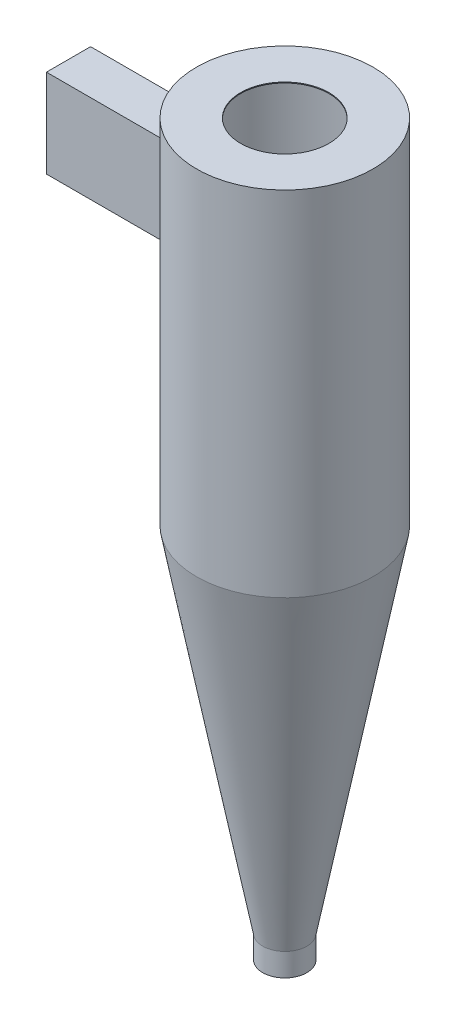
ISO-10303-21;
HEADER;
FILE_DESCRIPTION(('STEP AP214'),'2;1');
FILE_NAME('part.step','',(''),(''),'','','');
FILE_SCHEMA(('AUTOMOTIVE_DESIGN { 1 0 10303 214 1 1 1 1 }'));
ENDSEC;
DATA;
#1=APPLICATION_CONTEXT('core data for automotive mechanical design processes');
#2=APPLICATION_PROTOCOL_DEFINITION('international standard','automotive_design',2000,#1);
#3=PRODUCT_CONTEXT('',#1,'mechanical');
#4=PRODUCT('Part','Part','',(#3));
#5=PRODUCT_RELATED_PRODUCT_CATEGORY('part','',(#4));
#6=PRODUCT_DEFINITION_FORMATION('','',#4);
#7=PRODUCT_DEFINITION_CONTEXT('part definition',#1,'design');
#8=PRODUCT_DEFINITION('design','',#6,#7);
#9=PRODUCT_DEFINITION_SHAPE('','',#8);
#10=(LENGTH_UNIT() NAMED_UNIT(*) SI_UNIT(.MILLI.,.METRE.));
#11=(NAMED_UNIT(*) PLANE_ANGLE_UNIT() SI_UNIT($,.RADIAN.));
#12=(NAMED_UNIT(*) SI_UNIT($,.STERADIAN.) SOLID_ANGLE_UNIT());
#13=UNCERTAINTY_MEASURE_WITH_UNIT(LENGTH_MEASURE(1.E-05),#10,'distance_accuracy_value','');
#14=(GEOMETRIC_REPRESENTATION_CONTEXT(3) GLOBAL_UNCERTAINTY_ASSIGNED_CONTEXT((#13)) GLOBAL_UNIT_ASSIGNED_CONTEXT((#10,
#11,#12)) REPRESENTATION_CONTEXT('',''));
#15=CARTESIAN_POINT('',(0.,0.,0.));
#16=DIRECTION('',(0.,0.,1.));
#17=DIRECTION('',(1.,0.,0.));
#18=AXIS2_PLACEMENT_3D('',#15,#16,#17);
#19=CARTESIAN_POINT('',(0.,0.,105.));
#20=DIRECTION('',(0.,0.,1.));
#21=DIRECTION('',(1.,0.,0.));
#22=AXIS2_PLACEMENT_3D('',#19,#20,#21);
#23=PLANE('',#22);
#24=DIRECTION('',(1.,0.,0.));
#25=VECTOR('',#24,1.);
#26=CARTESIAN_POINT('',(0.,3535.,105.));
#27=LINE('',#26,#25);
#28=CARTESIAN_POINT('',(-1000.,3535.,105.));
#29=VERTEX_POINT('',#28);
#30=CARTESIAN_POINT('',(-483.735464897913,3535.,105.));
#31=VERTEX_POINT('',#30);
#32=EDGE_CURVE('E124',#29,#31,#27,.T.);
#33=ORIENTED_EDGE('',*,*,#32,.T.);
#34=DIRECTION('',(0.,-1.,0.));
#35=VECTOR('',#34,1.);
#36=CARTESIAN_POINT('',(-483.735464897913,0.,105.));
#37=LINE('',#36,#35);
#38=CARTESIAN_POINT('',(-483.735464897913,4025.,105.));
#39=VERTEX_POINT('',#38);
#40=EDGE_CURVE('E116',#31,#39,#37,.F.);
#41=ORIENTED_EDGE('',*,*,#40,.T.);
#42=DIRECTION('',(-1.,0.,0.));
#43=VECTOR('',#42,1.);
#44=CARTESIAN_POINT('',(0.,4025.,105.));
#45=LINE('',#44,#43);
#46=CARTESIAN_POINT('',(-1000.,4025.,105.));
#47=VERTEX_POINT('',#46);
#48=EDGE_CURVE('E115',#39,#47,#45,.T.);
#49=ORIENTED_EDGE('',*,*,#48,.T.);
#50=DIRECTION('',(0.,-1.,0.));
#51=VECTOR('',#50,1.);
#52=CARTESIAN_POINT('',(-999.999999999998,-4.44089209850062E-13,105.));
#53=LINE('',#52,#51);
#54=EDGE_CURVE('E61',#47,#29,#53,.T.);
#55=ORIENTED_EDGE('',*,*,#54,.T.);
#56=EDGE_LOOP('',(#33,#41,#49,#55));
#57=FACE_BOUND('',#56,.T.);
#58=ADVANCED_FACE('F39',(#57),#23,.T.);
#59=CARTESIAN_POINT('',(0.,0.,345.));
#60=DIRECTION('',(0.,0.,1.));
#61=DIRECTION('',(1.,0.,0.));
#62=AXIS2_PLACEMENT_3D('',#59,#60,#61);
#63=PLANE('',#62);
#64=DIRECTION('',(0.,-1.,0.));
#65=VECTOR('',#64,1.);
#66=CARTESIAN_POINT('',(-354.964786985977,0.,345.));
#67=LINE('',#66,#65);
#68=CARTESIAN_POINT('',(-354.964786985977,3535.,345.));
#69=VERTEX_POINT('',#68);
#70=CARTESIAN_POINT('',(-354.964786985977,4025.,345.));
#71=VERTEX_POINT('',#70);
#72=EDGE_CURVE('E11',#69,#71,#67,.F.);
#73=ORIENTED_EDGE('',*,*,#72,.F.);
#74=DIRECTION('',(1.,0.,0.));
#75=VECTOR('',#74,1.);
#76=CARTESIAN_POINT('',(0.,3535.,345.));
#77=LINE('',#76,#75);
#78=CARTESIAN_POINT('',(-1000.,3535.,345.));
#79=VERTEX_POINT('',#78);
#80=EDGE_CURVE('E122',#79,#69,#77,.T.);
#81=ORIENTED_EDGE('',*,*,#80,.F.);
#82=DIRECTION('',(0.,-1.,0.));
#83=VECTOR('',#82,1.);
#84=CARTESIAN_POINT('',(-999.999999999998,-4.44089209850062E-13,345.));
#85=LINE('',#84,#83);
#86=CARTESIAN_POINT('',(-1000.,4025.,345.));
#87=VERTEX_POINT('',#86);
#88=EDGE_CURVE('E120',#87,#79,#85,.T.);
#89=ORIENTED_EDGE('',*,*,#88,.F.);
#90=DIRECTION('',(-1.,0.,0.));
#91=VECTOR('',#90,1.);
#92=CARTESIAN_POINT('',(0.,4025.,345.));
#93=LINE('',#92,#91);
#94=EDGE_CURVE('E113',#71,#87,#93,.T.);
#95=ORIENTED_EDGE('',*,*,#94,.F.);
#96=EDGE_LOOP('',(#73,#81,#89,#95));
#97=FACE_BOUND('',#96,.T.);
#98=ADVANCED_FACE('F118',(#97),#63,.F.);
#99=CARTESIAN_POINT('',(-1000.,4030.,100.));
#100=DIRECTION('',(-1.,0.,0.));
#101=DIRECTION('',(0.,-1.,0.));
#102=AXIS2_PLACEMENT_3D('',#99,#100,#101);
#103=PLANE('',#102);
#104=DIRECTION('',(0.,-1.,0.));
#105=VECTOR('',#104,1.);
#106=CARTESIAN_POINT('',(-1000.,4030.,350.));
#107=LINE('',#106,#105);
#108=CARTESIAN_POINT('',(-1000.,4030.,350.));
#109=VERTEX_POINT('',#108);
#110=CARTESIAN_POINT('',(-1000.,3530.,350.));
#111=VERTEX_POINT('',#110);
#112=EDGE_CURVE('E137',#109,#111,#107,.T.);
#113=ORIENTED_EDGE('',*,*,#112,.F.);
#114=DIRECTION('',(0.,0.,1.));
#115=VECTOR('',#114,1.);
#116=CARTESIAN_POINT('',(-1000.,4030.,100.));
#117=LINE('',#116,#115);
#118=CARTESIAN_POINT('',(-1000.,4030.,100.));
#119=VERTEX_POINT('',#118);
#120=EDGE_CURVE('E153',#119,#109,#117,.T.);
#121=ORIENTED_EDGE('',*,*,#120,.F.);
#122=DIRECTION('',(0.,-1.,0.));
#123=VECTOR('',#122,1.);
#124=CARTESIAN_POINT('',(-1000.,4030.,100.));
#125=LINE('',#124,#123);
#126=CARTESIAN_POINT('',(-1000.,3530.,100.));
#127=VERTEX_POINT('',#126);
#128=EDGE_CURVE('E138',#119,#127,#125,.T.);
#129=ORIENTED_EDGE('',*,*,#128,.T.);
#130=DIRECTION('',(0.,0.,1.));
#131=VECTOR('',#130,1.);
#132=CARTESIAN_POINT('',(-1000.,3530.,100.));
#133=LINE('',#132,#131);
#134=EDGE_CURVE('E147',#127,#111,#133,.T.);
#135=ORIENTED_EDGE('',*,*,#134,.T.);
#136=EDGE_LOOP('',(#113,#121,#129,#135));
#137=FACE_BOUND('',#136,.T.);
#138=DIRECTION('',(0.,0.,1.));
#139=VECTOR('',#138,1.);
#140=CARTESIAN_POINT('',(-1000.,4025.,100.));
#141=LINE('',#140,#139);
#142=EDGE_CURVE('E134',#47,#87,#141,.T.);
#143=ORIENTED_EDGE('',*,*,#142,.T.);
#144=ORIENTED_EDGE('',*,*,#88,.T.);
#145=DIRECTION('',(0.,0.,1.));
#146=VECTOR('',#145,1.);
#147=CARTESIAN_POINT('',(-1000.,3535.,100.));
#148=LINE('',#147,#146);
#149=EDGE_CURVE('E130',#29,#79,#148,.T.);
#150=ORIENTED_EDGE('',*,*,#149,.F.);
#151=ORIENTED_EDGE('',*,*,#54,.F.);
#152=EDGE_LOOP('',(#143,#144,#150,#151));
#153=FACE_BOUND('',#152,.T.);
#154=ADVANCED_FACE('F215',(#137,#153),#103,.T.);
#155=CARTESIAN_POINT('',(0.,0.,0.));
#156=DIRECTION('',(0.,-1.,0.));
#157=DIRECTION('',(0.,0.,-1.));
#158=AXIS2_PLACEMENT_3D('',#155,#156,#157);
#159=CYLINDRICAL_SURFACE('',#158,495.);
#160=CARTESIAN_POINT('',(0.,4125.,0.));
#161=DIRECTION('',(0.,-1.,0.));
#162=DIRECTION('',(0.,0.,-1.));
#163=AXIS2_PLACEMENT_3D('',#160,#161,#162);
#164=CIRCLE('',#163,495.);
#165=CARTESIAN_POINT('',(0.,4125.,-495.));
#166=VERTEX_POINT('',#165);
#167=EDGE_CURVE('E178',#166,#166,#164,.T.);
#168=ORIENTED_EDGE('',*,*,#167,.F.);
#169=EDGE_LOOP('',(#168));
#170=FACE_BOUND('',#169,.T.);
#171=CARTESIAN_POINT('',(0.,3535.,0.));
#172=DIRECTION('',(0.,-1.,0.));
#173=DIRECTION('',(0.,0.,-1.));
#174=AXIS2_PLACEMENT_3D('',#171,#172,#173);
#175=CIRCLE('',#174,495.);
#176=EDGE_CURVE('E53',#31,#69,#175,.F.);
#177=ORIENTED_EDGE('',*,*,#176,.T.);
#178=ORIENTED_EDGE('',*,*,#72,.T.);
#179=CARTESIAN_POINT('',(0.,4025.,0.));
#180=DIRECTION('',(0.,1.,0.));
#181=DIRECTION('',(0.,0.,1.));
#182=AXIS2_PLACEMENT_3D('',#179,#180,#181);
#183=CIRCLE('',#182,495.);
#184=EDGE_CURVE('E104',#71,#39,#183,.F.);
#185=ORIENTED_EDGE('',*,*,#184,.T.);
#186=ORIENTED_EDGE('',*,*,#40,.F.);
#187=EDGE_LOOP('',(#177,#178,#185,#186));
#188=FACE_BOUND('',#187,.T.);
#189=CARTESIAN_POINT('',(0.,2130.4647009935,0.));
#190=DIRECTION('',(0.,-1.,0.));
#191=DIRECTION('',(0.,0.,-1.));
#192=AXIS2_PLACEMENT_3D('',#189,#190,#191);
#193=CIRCLE('',#192,495.);
#194=CARTESIAN_POINT('',(0.,2130.4647009935,495.));
#195=VERTEX_POINT('',#194);
#196=EDGE_CURVE('E175',#195,#195,#193,.T.);
#197=ORIENTED_EDGE('',*,*,#196,.T.);
#198=EDGE_LOOP('',(#197));
#199=FACE_BOUND('',#198,.T.);
#200=ADVANCED_FACE('F102',(#170,#188,#199),#159,.F.);
#201=CARTESIAN_POINT('',(0.,0.,0.));
#202=DIRECTION('',(0.,-1.,0.));
#203=DIRECTION('',(0.,0.,-1.));
#204=AXIS2_PLACEMENT_3D('',#201,#202,#203);
#205=CYLINDRICAL_SURFACE('',#204,500.);
#206=CARTESIAN_POINT('',(0.,4130.,0.));
#207=DIRECTION('',(0.,-1.,0.));
#208=DIRECTION('',(0.,0.,-1.));
#209=AXIS2_PLACEMENT_3D('',#206,#207,#208);
#210=CIRCLE('',#209,500.);
#211=CARTESIAN_POINT('',(0.,4130.,-500.));
#212=VERTEX_POINT('',#211);
#213=EDGE_CURVE('E156',#212,#212,#210,.T.);
#214=ORIENTED_EDGE('',*,*,#213,.T.);
#215=EDGE_LOOP('',(#214));
#216=FACE_BOUND('',#215,.T.);
#217=CARTESIAN_POINT('',(0.,2130.,0.));
#218=DIRECTION('',(0.,-1.,0.));
#219=DIRECTION('',(0.,0.,-1.));
#220=AXIS2_PLACEMENT_3D('',#217,#218,#219);
#221=CIRCLE('',#220,500.);
#222=CARTESIAN_POINT('',(0.,2130.,500.));
#223=VERTEX_POINT('',#222);
#224=EDGE_CURVE('E160',#223,#223,#221,.T.);
#225=ORIENTED_EDGE('',*,*,#224,.F.);
#226=EDGE_LOOP('',(#225));
#227=FACE_BOUND('',#226,.T.);
#228=DIRECTION('',(0.,-1.,0.));
#229=VECTOR('',#228,1.);
#230=CARTESIAN_POINT('',(-489.897948556635,0.,100.));
#231=LINE('',#230,#229);
#232=CARTESIAN_POINT('',(-489.897948556635,4030.,100.));
#233=VERTEX_POINT('',#232);
#234=CARTESIAN_POINT('',(-489.897948556635,3530.,100.));
#235=VERTEX_POINT('',#234);
#236=EDGE_CURVE('E47',#233,#235,#231,.T.);
#237=ORIENTED_EDGE('',*,*,#236,.F.);
#238=CARTESIAN_POINT('',(0.,4030.,0.));
#239=DIRECTION('',(0.,1.,0.));
#240=DIRECTION('',(0.,0.,1.));
#241=AXIS2_PLACEMENT_3D('',#238,#239,#240);
#242=CIRCLE('',#241,500.);
#243=CARTESIAN_POINT('',(-357.071421427142,4030.,350.));
#244=VERTEX_POINT('',#243);
#245=EDGE_CURVE('E193',#233,#244,#242,.T.);
#246=ORIENTED_EDGE('',*,*,#245,.T.);
#247=DIRECTION('',(0.,-1.,0.));
#248=VECTOR('',#247,1.);
#249=CARTESIAN_POINT('',(-357.071421427142,0.,350.));
#250=LINE('',#249,#248);
#251=CARTESIAN_POINT('',(-357.071421427142,3530.,350.));
#252=VERTEX_POINT('',#251);
#253=EDGE_CURVE('E187',#244,#252,#250,.T.);
#254=ORIENTED_EDGE('',*,*,#253,.T.);
#255=CARTESIAN_POINT('',(0.,3530.,0.));
#256=DIRECTION('',(0.,-1.,0.));
#257=DIRECTION('',(0.,0.,-1.));
#258=AXIS2_PLACEMENT_3D('',#255,#256,#257);
#259=CIRCLE('',#258,500.);
#260=EDGE_CURVE('E190',#252,#235,#259,.T.);
#261=ORIENTED_EDGE('',*,*,#260,.T.);
#262=EDGE_LOOP('',(#237,#246,#254,#261));
#263=FACE_BOUND('',#262,.T.);
#264=ADVANCED_FACE('F206',(#216,#227,#263),#205,.T.);
#265=CARTESIAN_POINT('',(-500.,4130.,0.));
#266=DIRECTION('',(0.,-1.,0.));
#267=DIRECTION('',(0.,0.,-1.));
#268=AXIS2_PLACEMENT_3D('',#265,#266,#267);
#269=PLANE('',#268);
#270=ORIENTED_EDGE('',*,*,#213,.F.);
#271=EDGE_LOOP('',(#270));
#272=FACE_BOUND('',#271,.T.);
#273=CARTESIAN_POINT('',(0.,4130.,0.));
#274=DIRECTION('',(0.,-1.,0.));
#275=DIRECTION('',(0.,0.,-1.));
#276=AXIS2_PLACEMENT_3D('',#273,#274,#275);
#277=CIRCLE('',#276,250.);
#278=CARTESIAN_POINT('',(0.,4130.,-250.));
#279=VERTEX_POINT('',#278);
#280=EDGE_CURVE('E184',#279,#279,#277,.T.);
#281=ORIENTED_EDGE('',*,*,#280,.T.);
#282=EDGE_LOOP('',(#281));
#283=FACE_BOUND('',#282,.T.);
#284=ADVANCED_FACE('F41',(#272,#283),#269,.F.);
#285=CARTESIAN_POINT('',(0.,0.,0.));
#286=DIRECTION('',(0.,-1.,0.));
#287=DIRECTION('',(0.,0.,-1.));
#288=AXIS2_PLACEMENT_3D('',#285,#286,#287);
#289=CYLINDRICAL_SURFACE('',#288,250.);
#290=ORIENTED_EDGE('',*,*,#280,.F.);
#291=EDGE_LOOP('',(#290));
#292=FACE_BOUND('',#291,.T.);
#293=CARTESIAN_POINT('',(0.,4125.,0.));
#294=DIRECTION('',(0.,-1.,0.));
#295=DIRECTION('',(0.,0.,-1.));
#296=AXIS2_PLACEMENT_3D('',#293,#294,#295);
#297=CIRCLE('',#296,250.);
#298=CARTESIAN_POINT('',(0.,4125.,-250.));
#299=VERTEX_POINT('',#298);
#300=EDGE_CURVE('E181',#299,#299,#297,.T.);
#301=ORIENTED_EDGE('',*,*,#300,.T.);
#302=EDGE_LOOP('',(#301));
#303=FACE_BOUND('',#302,.T.);
#304=ADVANCED_FACE('F269',(#292,#303),#289,.F.);
#305=CARTESIAN_POINT('',(-495.,4125.,0.));
#306=DIRECTION('',(0.,1.,0.));
#307=DIRECTION('',(0.,0.,1.));
#308=AXIS2_PLACEMENT_3D('',#305,#306,#307);
#309=PLANE('',#308);
#310=ORIENTED_EDGE('',*,*,#300,.F.);
#311=EDGE_LOOP('',(#310));
#312=FACE_BOUND('',#311,.T.);
#313=ORIENTED_EDGE('',*,*,#167,.T.);
#314=EDGE_LOOP('',(#313));
#315=FACE_BOUND('',#314,.T.);
#316=ADVANCED_FACE('F263',(#312,#315),#309,.F.);
#317=CARTESIAN_POINT('',(0.,130.4647009935,0.));
#318=DIRECTION('',(0.,1.,0.));
#319=DIRECTION('',(0.,0.,1.));
#320=AXIS2_PLACEMENT_3D('',#317,#318,#319);
#321=CONICAL_SURFACE('',#320,120.,0.185347949995695);
#322=CARTESIAN_POINT('',(0.,130.4647009935,0.));
#323=DIRECTION('',(0.,-1.,0.));
#324=DIRECTION('',(0.,0.,-1.));
#325=AXIS2_PLACEMENT_3D('',#322,#323,#324);
#326=CIRCLE('',#325,120.);
#327=CARTESIAN_POINT('',(0.,130.4647009935,120.));
#328=VERTEX_POINT('',#327);
#329=EDGE_CURVE('E172',#328,#328,#326,.T.);
#330=CARTESIAN_POINT('',(0.,2130.4647009935,495.));
#331=CARTESIAN_POINT('',(0.,2109.63136766017,491.09375));
#332=CARTESIAN_POINT('',(0.,2088.79803432683,487.1875));
#333=CARTESIAN_POINT('',(0.,2047.13136766017,479.375));
#334=CARTESIAN_POINT('',(0.,2026.29803432683,475.46875));
#335=CARTESIAN_POINT('',(0.,1984.63136766017,467.65625));
#336=CARTESIAN_POINT('',(0.,1963.79803432683,463.75));
#337=CARTESIAN_POINT('',(0.,1922.13136766017,455.9375));
#338=CARTESIAN_POINT('',(0.,1901.29803432683,452.03125));
#339=CARTESIAN_POINT('',(0.,1859.63136766017,444.21875));
#340=CARTESIAN_POINT('',(0.,1838.79803432683,440.3125));
#341=CARTESIAN_POINT('',(0.,1797.13136766017,432.5));
#342=CARTESIAN_POINT('',(0.,1776.29803432683,428.59375));
#343=CARTESIAN_POINT('',(0.,1734.63136766017,420.78125));
#344=CARTESIAN_POINT('',(0.,1713.79803432683,416.875));
#345=CARTESIAN_POINT('',(0.,1672.13136766017,409.0625));
#346=CARTESIAN_POINT('',(0.,1651.29803432683,405.15625));
#347=CARTESIAN_POINT('',(0.,1609.63136766017,397.34375));
#348=CARTESIAN_POINT('',(0.,1588.79803432683,393.4375));
#349=CARTESIAN_POINT('',(0.,1547.13136766017,385.625));
#350=CARTESIAN_POINT('',(0.,1526.29803432683,381.71875));
#351=CARTESIAN_POINT('',(0.,1484.63136766017,373.90625));
#352=CARTESIAN_POINT('',(0.,1463.79803432683,370.));
#353=CARTESIAN_POINT('',(0.,1422.13136766017,362.1875));
#354=CARTESIAN_POINT('',(0.,1401.29803432683,358.28125));
#355=CARTESIAN_POINT('',(0.,1359.63136766017,350.46875));
#356=CARTESIAN_POINT('',(0.,1338.79803432683,346.5625));
#357=CARTESIAN_POINT('',(0.,1297.13136766017,338.75));
#358=CARTESIAN_POINT('',(0.,1276.29803432683,334.84375));
#359=CARTESIAN_POINT('',(0.,1234.63136766017,327.03125));
#360=CARTESIAN_POINT('',(0.,1213.79803432683,323.125));
#361=CARTESIAN_POINT('',(0.,1172.13136766017,315.3125));
#362=CARTESIAN_POINT('',(0.,1151.29803432683,311.40625));
#363=CARTESIAN_POINT('',(0.,1109.63136766017,303.59375));
#364=CARTESIAN_POINT('',(0.,1088.79803432683,299.6875));
#365=CARTESIAN_POINT('',(0.,1047.13136766017,291.875));
#366=CARTESIAN_POINT('',(0.,1026.29803432683,287.96875));
#367=CARTESIAN_POINT('',(0.,984.631367660166,280.15625));
#368=CARTESIAN_POINT('',(0.,963.798034326833,276.25));
#369=CARTESIAN_POINT('',(0.,922.131367660166,268.4375));
#370=CARTESIAN_POINT('',(0.,901.298034326833,264.53125));
#371=CARTESIAN_POINT('',(0.,859.631367660166,256.71875));
#372=CARTESIAN_POINT('',(0.,838.798034326833,252.8125));
#373=CARTESIAN_POINT('',(0.,797.131367660166,245.));
#374=CARTESIAN_POINT('',(0.,776.298034326833,241.09375));
#375=CARTESIAN_POINT('',(0.,734.631367660166,233.28125));
#376=CARTESIAN_POINT('',(0.,713.798034326833,229.375));
#377=CARTESIAN_POINT('',(0.,672.131367660166,221.5625));
#378=CARTESIAN_POINT('',(0.,651.298034326833,217.65625));
#379=CARTESIAN_POINT('',(0.,609.631367660166,209.84375));
#380=CARTESIAN_POINT('',(0.,588.798034326833,205.9375));
#381=CARTESIAN_POINT('',(0.,547.131367660166,198.125));
#382=CARTESIAN_POINT('',(0.,526.298034326833,194.21875));
#383=CARTESIAN_POINT('',(0.,484.631367660166,186.40625));
#384=CARTESIAN_POINT('',(0.,463.798034326833,182.5));
#385=CARTESIAN_POINT('',(0.,422.131367660166,174.6875));
#386=CARTESIAN_POINT('',(0.,401.298034326833,170.78125));
#387=CARTESIAN_POINT('',(0.,359.631367660166,162.96875));
#388=CARTESIAN_POINT('',(0.,338.798034326833,159.0625));
#389=CARTESIAN_POINT('',(0.,297.131367660166,151.25));
#390=CARTESIAN_POINT('',(0.,276.298034326833,147.34375));
#391=CARTESIAN_POINT('',(0.,234.631367660166,139.53125));
#392=CARTESIAN_POINT('',(0.,213.798034326833,135.625));
#393=CARTESIAN_POINT('',(0.,172.131367660166,127.8125));
#394=CARTESIAN_POINT('',(0.,151.298034326833,123.90625));
#395=CARTESIAN_POINT('',(0.,130.4647009935,120.));
#396=B_SPLINE_CURVE_WITH_KNOTS('',3,(#330,#331,#332,#333,#334,#335,#336,#337,#338,#339,#340,
#341,#342,#343,#344,#345,#346,#347,#348,#349,#350,#351,#352,#353,#354,#355,#356,#357,#358,#359,
#360,#361,#362,#363,#364,#365,#366,#367,#368,#369,#370,#371,#372,#373,#374,#375,#376,#377,#378,
#379,#380,#381,#382,#383,#384,#385,#386,#387,#388,#389,#390,#391,#392,#393,#394,#395),
.UNSPECIFIED.,.F.,.F.,(4,2,2,2,2,2,2,2,2,2,2,2,2,2,2,2,2,2,2,2,2,2,2,2,2,2,2,2,2,2,2,2,4),(0.,
63.5891429535145,127.178285907029,190.767428860543,254.356571814058,317.945714767572,
381.534857721087,445.124000674601,508.713143628116,572.30228658163,635.891429535145,
699.480572488659,763.069715442174,826.658858395688,890.248001349203,953.837144302717,
1017.42628725623,1081.01543020975,1144.60457316326,1208.19371611678,1271.78285907029,
1335.3720020238,1398.96114497732,1462.55028793083,1526.13943088435,1589.72857383786,
1653.31771679138,1716.90685974489,1780.49600269841,1844.08514565192,1907.67428860543,
1971.26343155895,2034.85257451246),.UNSPECIFIED.);
#397=EDGE_CURVE('BSEAM259',#195,#328,#396,.T.);
#398=ORIENTED_EDGE('',*,*,#196,.F.);
#399=ORIENTED_EDGE('',*,*,#329,.T.);
#400=ORIENTED_EDGE('',*,*,#397,.T.);
#401=ORIENTED_EDGE('',*,*,#397,.F.);
#402=EDGE_LOOP('',(#398,#400,#399,#401));
#403=FACE_BOUND('',#402,.T.);
#404=ADVANCED_FACE('F259',(#403),#321,.F.);
#405=CARTESIAN_POINT('',(0.,0.,0.));
#406=DIRECTION('',(0.,-1.,0.));
#407=DIRECTION('',(0.,0.,-1.));
#408=AXIS2_PLACEMENT_3D('',#405,#406,#407);
#409=CYLINDRICAL_SURFACE('',#408,120.);
#410=ORIENTED_EDGE('',*,*,#329,.F.);
#411=EDGE_LOOP('',(#410));
#412=FACE_BOUND('',#411,.T.);
#413=CARTESIAN_POINT('',(0.,0.,0.));
#414=DIRECTION('',(0.,-1.,0.));
#415=DIRECTION('',(0.,0.,-1.));
#416=AXIS2_PLACEMENT_3D('',#413,#414,#415);
#417=CIRCLE('',#416,120.);
#418=CARTESIAN_POINT('',(0.,0.,-120.));
#419=VERTEX_POINT('',#418);
#420=EDGE_CURVE('E169',#419,#419,#417,.T.);
#421=ORIENTED_EDGE('',*,*,#420,.T.);
#422=EDGE_LOOP('',(#421));
#423=FACE_BOUND('',#422,.T.);
#424=ADVANCED_FACE('F255',(#412,#423),#409,.F.);
#425=CARTESIAN_POINT('',(-125.,0.,0.));
#426=DIRECTION('',(0.,1.,0.));
#427=DIRECTION('',(0.,0.,1.));
#428=AXIS2_PLACEMENT_3D('',#425,#426,#427);
#429=PLANE('',#428);
#430=ORIENTED_EDGE('',*,*,#420,.F.);
#431=EDGE_LOOP('',(#430));
#432=FACE_BOUND('',#431,.T.);
#433=CARTESIAN_POINT('',(0.,0.,0.));
#434=DIRECTION('',(0.,-1.,0.));
#435=DIRECTION('',(0.,0.,-1.));
#436=AXIS2_PLACEMENT_3D('',#433,#434,#435);
#437=CIRCLE('',#436,125.);
#438=CARTESIAN_POINT('',(0.,0.,-125.));
#439=VERTEX_POINT('',#438);
#440=EDGE_CURVE('E166',#439,#439,#437,.T.);
#441=ORIENTED_EDGE('',*,*,#440,.T.);
#442=EDGE_LOOP('',(#441));
#443=FACE_BOUND('',#442,.T.);
#444=ADVANCED_FACE('F251',(#432,#443),#429,.F.);
#445=CARTESIAN_POINT('',(0.,0.,0.));
#446=DIRECTION('',(0.,-1.,0.));
#447=DIRECTION('',(0.,0.,-1.));
#448=AXIS2_PLACEMENT_3D('',#445,#446,#447);
#449=CYLINDRICAL_SURFACE('',#448,125.);
#450=ORIENTED_EDGE('',*,*,#440,.F.);
#451=EDGE_LOOP('',(#450));
#452=FACE_BOUND('',#451,.T.);
#453=CARTESIAN_POINT('',(0.,130.,0.));
#454=DIRECTION('',(0.,-1.,0.));
#455=DIRECTION('',(0.,0.,-1.));
#456=AXIS2_PLACEMENT_3D('',#453,#454,#455);
#457=CIRCLE('',#456,125.);
#458=CARTESIAN_POINT('',(0.,130.,125.));
#459=VERTEX_POINT('',#458);
#460=EDGE_CURVE('E163',#459,#459,#457,.T.);
#461=ORIENTED_EDGE('',*,*,#460,.T.);
#462=EDGE_LOOP('',(#461));
#463=FACE_BOUND('',#462,.T.);
#464=ADVANCED_FACE('F247',(#452,#463),#449,.T.);
#465=CARTESIAN_POINT('',(0.,2130.,0.));
#466=DIRECTION('',(0.,1.,0.));
#467=DIRECTION('',(0.,0.,1.));
#468=AXIS2_PLACEMENT_3D('',#465,#466,#467);
#469=CONICAL_SURFACE('',#468,500.,0.185347949995695);
#470=CARTESIAN_POINT('',(0.,130.,125.));
#471=CARTESIAN_POINT('',(0.,150.833333333333,128.90625));
#472=CARTESIAN_POINT('',(0.,171.666666666667,132.8125));
#473=CARTESIAN_POINT('',(0.,213.333333333333,140.625));
#474=CARTESIAN_POINT('',(0.,234.166666666667,144.53125));
#475=CARTESIAN_POINT('',(0.,275.833333333333,152.34375));
#476=CARTESIAN_POINT('',(0.,296.666666666667,156.25));
#477=CARTESIAN_POINT('',(0.,338.333333333333,164.0625));
#478=CARTESIAN_POINT('',(0.,359.166666666667,167.96875));
#479=CARTESIAN_POINT('',(0.,400.833333333333,175.78125));
#480=CARTESIAN_POINT('',(0.,421.666666666667,179.6875));
#481=CARTESIAN_POINT('',(0.,463.333333333333,187.5));
#482=CARTESIAN_POINT('',(0.,484.166666666667,191.40625));
#483=CARTESIAN_POINT('',(0.,525.833333333333,199.21875));
#484=CARTESIAN_POINT('',(0.,546.666666666667,203.125));
#485=CARTESIAN_POINT('',(0.,588.333333333333,210.9375));
#486=CARTESIAN_POINT('',(0.,609.166666666667,214.84375));
#487=CARTESIAN_POINT('',(0.,650.833333333333,222.65625));
#488=CARTESIAN_POINT('',(0.,671.666666666667,226.5625));
#489=CARTESIAN_POINT('',(0.,713.333333333333,234.375));
#490=CARTESIAN_POINT('',(0.,734.166666666667,238.28125));
#491=CARTESIAN_POINT('',(0.,775.833333333333,246.09375));
#492=CARTESIAN_POINT('',(0.,796.666666666667,250.));
#493=CARTESIAN_POINT('',(0.,838.333333333333,257.8125));
#494=CARTESIAN_POINT('',(0.,859.166666666667,261.71875));
#495=CARTESIAN_POINT('',(0.,900.833333333333,269.53125));
#496=CARTESIAN_POINT('',(0.,921.666666666667,273.4375));
#497=CARTESIAN_POINT('',(0.,963.333333333333,281.25));
#498=CARTESIAN_POINT('',(0.,984.166666666667,285.15625));
#499=CARTESIAN_POINT('',(0.,1025.83333333333,292.96875));
#500=CARTESIAN_POINT('',(0.,1046.66666666667,296.875));
#501=CARTESIAN_POINT('',(0.,1088.33333333333,304.6875));
#502=CARTESIAN_POINT('',(0.,1109.16666666667,308.59375));
#503=CARTESIAN_POINT('',(0.,1150.83333333333,316.40625));
#504=CARTESIAN_POINT('',(0.,1171.66666666667,320.3125));
#505=CARTESIAN_POINT('',(0.,1213.33333333333,328.125));
#506=CARTESIAN_POINT('',(0.,1234.16666666667,332.03125));
#507=CARTESIAN_POINT('',(0.,1275.83333333333,339.84375));
#508=CARTESIAN_POINT('',(0.,1296.66666666667,343.75));
#509=CARTESIAN_POINT('',(0.,1338.33333333333,351.5625));
#510=CARTESIAN_POINT('',(0.,1359.16666666667,355.46875));
#511=CARTESIAN_POINT('',(0.,1400.83333333333,363.28125));
#512=CARTESIAN_POINT('',(0.,1421.66666666667,367.1875));
#513=CARTESIAN_POINT('',(0.,1463.33333333333,375.));
#514=CARTESIAN_POINT('',(0.,1484.16666666667,378.90625));
#515=CARTESIAN_POINT('',(0.,1525.83333333333,386.71875));
#516=CARTESIAN_POINT('',(0.,1546.66666666667,390.625));
#517=CARTESIAN_POINT('',(0.,1588.33333333333,398.4375));
#518=CARTESIAN_POINT('',(0.,1609.16666666667,402.34375));
#519=CARTESIAN_POINT('',(0.,1650.83333333333,410.15625));
#520=CARTESIAN_POINT('',(0.,1671.66666666667,414.0625));
#521=CARTESIAN_POINT('',(0.,1713.33333333333,421.875));
#522=CARTESIAN_POINT('',(0.,1734.16666666667,425.78125));
#523=CARTESIAN_POINT('',(0.,1775.83333333333,433.59375));
#524=CARTESIAN_POINT('',(0.,1796.66666666667,437.5));
#525=CARTESIAN_POINT('',(0.,1838.33333333333,445.3125));
#526=CARTESIAN_POINT('',(0.,1859.16666666667,449.21875));
#527=CARTESIAN_POINT('',(0.,1900.83333333333,457.03125));
#528=CARTESIAN_POINT('',(0.,1921.66666666667,460.9375));
#529=CARTESIAN_POINT('',(0.,1963.33333333333,468.75));
#530=CARTESIAN_POINT('',(0.,1984.16666666667,472.65625));
#531=CARTESIAN_POINT('',(0.,2025.83333333333,480.46875));
#532=CARTESIAN_POINT('',(0.,2046.66666666667,484.375));
#533=CARTESIAN_POINT('',(0.,2088.33333333333,492.1875));
#534=CARTESIAN_POINT('',(0.,2109.16666666667,496.09375));
#535=CARTESIAN_POINT('',(0.,2130.,500.));
#536=B_SPLINE_CURVE_WITH_KNOTS('',3,(#470,#471,#472,#473,#474,#475,#476,#477,#478,#479,#480,
#481,#482,#483,#484,#485,#486,#487,#488,#489,#490,#491,#492,#493,#494,#495,#496,#497,#498,#499,
#500,#501,#502,#503,#504,#505,#506,#507,#508,#509,#510,#511,#512,#513,#514,#515,#516,#517,#518,
#519,#520,#521,#522,#523,#524,#525,#526,#527,#528,#529,#530,#531,#532,#533,#534,#535),
.UNSPECIFIED.,.F.,.F.,(4,2,2,2,2,2,2,2,2,2,2,2,2,2,2,2,2,2,2,2,2,2,2,2,2,2,2,2,2,2,2,2,4),(0.,
63.5891429535145,127.178285907029,190.767428860543,254.356571814058,317.945714767572,
381.534857721087,445.124000674601,508.713143628116,572.30228658163,635.891429535145,
699.480572488659,763.069715442174,826.658858395688,890.248001349203,953.837144302717,
1017.42628725623,1081.01543020975,1144.60457316326,1208.19371611678,1271.78285907029,
1335.3720020238,1398.96114497732,1462.55028793083,1526.13943088435,1589.72857383786,
1653.31771679138,1716.90685974489,1780.49600269841,1844.08514565192,1907.67428860543,
1971.26343155895,2034.85257451246),.UNSPECIFIED.);
#537=EDGE_CURVE('BSEAM235',#459,#223,#536,.T.);
#538=ORIENTED_EDGE('',*,*,#460,.F.);
#539=ORIENTED_EDGE('',*,*,#224,.T.);
#540=ORIENTED_EDGE('',*,*,#537,.T.);
#541=ORIENTED_EDGE('',*,*,#537,.F.);
#542=EDGE_LOOP('',(#538,#540,#539,#541));
#543=FACE_BOUND('',#542,.T.);
#544=ADVANCED_FACE('F235',(#543),#469,.T.);
#545=CARTESIAN_POINT('',(0.,0.,100.));
#546=DIRECTION('',(0.,0.,1.));
#547=DIRECTION('',(1.,0.,0.));
#548=AXIS2_PLACEMENT_3D('',#545,#546,#547);
#549=PLANE('',#548);
#550=DIRECTION('',(-1.,0.,0.));
#551=VECTOR('',#550,1.);
#552=CARTESIAN_POINT('',(-1000.,4030.,100.));
#553=LINE('',#552,#551);
#554=EDGE_CURVE('E145',#233,#119,#553,.T.);
#555=ORIENTED_EDGE('',*,*,#554,.F.);
#556=ORIENTED_EDGE('',*,*,#236,.T.);
#557=DIRECTION('',(1.,0.,0.));
#558=VECTOR('',#557,1.);
#559=CARTESIAN_POINT('',(-1000.,3530.,100.));
#560=LINE('',#559,#558);
#561=EDGE_CURVE('E141',#127,#235,#560,.T.);
#562=ORIENTED_EDGE('',*,*,#561,.F.);
#563=ORIENTED_EDGE('',*,*,#128,.F.);
#564=EDGE_LOOP('',(#555,#556,#562,#563));
#565=FACE_BOUND('',#564,.T.);
#566=ADVANCED_FACE('F199',(#565),#549,.F.);
#567=CARTESIAN_POINT('',(0.,0.,350.));
#568=DIRECTION('',(0.,0.,1.));
#569=DIRECTION('',(1.,0.,0.));
#570=AXIS2_PLACEMENT_3D('',#567,#568,#569);
#571=PLANE('',#570);
#572=ORIENTED_EDGE('',*,*,#253,.F.);
#573=DIRECTION('',(-1.,0.,0.));
#574=VECTOR('',#573,1.);
#575=CARTESIAN_POINT('',(-1000.,4030.,350.));
#576=LINE('',#575,#574);
#577=EDGE_CURVE('E142',#244,#109,#576,.T.);
#578=ORIENTED_EDGE('',*,*,#577,.T.);
#579=ORIENTED_EDGE('',*,*,#112,.T.);
#580=DIRECTION('',(1.,0.,0.));
#581=VECTOR('',#580,1.);
#582=CARTESIAN_POINT('',(-1000.,3530.,350.));
#583=LINE('',#582,#581);
#584=EDGE_CURVE('E150',#111,#252,#583,.T.);
#585=ORIENTED_EDGE('',*,*,#584,.T.);
#586=EDGE_LOOP('',(#572,#578,#579,#585));
#587=FACE_BOUND('',#586,.T.);
#588=ADVANCED_FACE('F209',(#587),#571,.T.);
#589=CARTESIAN_POINT('',(-1000.,3530.,100.));
#590=DIRECTION('',(0.,-1.,0.));
#591=DIRECTION('',(0.,0.,-1.));
#592=AXIS2_PLACEMENT_3D('',#589,#590,#591);
#593=PLANE('',#592);
#594=ORIENTED_EDGE('',*,*,#260,.F.);
#595=ORIENTED_EDGE('',*,*,#584,.F.);
#596=ORIENTED_EDGE('',*,*,#134,.F.);
#597=ORIENTED_EDGE('',*,*,#561,.T.);
#598=EDGE_LOOP('',(#594,#595,#596,#597));
#599=FACE_BOUND('',#598,.T.);
#600=ADVANCED_FACE('F204',(#599),#593,.T.);
#601=CARTESIAN_POINT('',(-1000.,4030.,100.));
#602=DIRECTION('',(0.,1.,0.));
#603=DIRECTION('',(0.,0.,1.));
#604=AXIS2_PLACEMENT_3D('',#601,#602,#603);
#605=PLANE('',#604);
#606=ORIENTED_EDGE('',*,*,#245,.F.);
#607=ORIENTED_EDGE('',*,*,#554,.T.);
#608=ORIENTED_EDGE('',*,*,#120,.T.);
#609=ORIENTED_EDGE('',*,*,#577,.F.);
#610=EDGE_LOOP('',(#606,#607,#608,#609));
#611=FACE_BOUND('',#610,.T.);
#612=ADVANCED_FACE('F211',(#611),#605,.T.);
#613=CARTESIAN_POINT('',(-1000.,4025.,100.));
#614=DIRECTION('',(0.,1.,0.));
#615=DIRECTION('',(0.,0.,1.));
#616=AXIS2_PLACEMENT_3D('',#613,#614,#615);
#617=PLANE('',#616);
#618=ORIENTED_EDGE('',*,*,#184,.F.);
#619=ORIENTED_EDGE('',*,*,#94,.T.);
#620=ORIENTED_EDGE('',*,*,#142,.F.);
#621=ORIENTED_EDGE('',*,*,#48,.F.);
#622=EDGE_LOOP('',(#618,#619,#620,#621));
#623=FACE_BOUND('',#622,.T.);
#624=ADVANCED_FACE('F111',(#623),#617,.F.);
#625=CARTESIAN_POINT('',(-1000.,3535.,100.));
#626=DIRECTION('',(0.,-1.,0.));
#627=DIRECTION('',(0.,0.,-1.));
#628=AXIS2_PLACEMENT_3D('',#625,#626,#627);
#629=PLANE('',#628);
#630=ORIENTED_EDGE('',*,*,#176,.F.);
#631=ORIENTED_EDGE('',*,*,#32,.F.);
#632=ORIENTED_EDGE('',*,*,#149,.T.);
#633=ORIENTED_EDGE('',*,*,#80,.T.);
#634=EDGE_LOOP('',(#630,#631,#632,#633));
#635=FACE_BOUND('',#634,.T.);
#636=ADVANCED_FACE('F221',(#635),#629,.F.);
#637=CLOSED_SHELL('',(#58,#98,#154,#200,#264,#284,#304,#316,#404,#424,#444,#464,#544,#566,#588,
#600,#612,#624,#636));
#638=MANIFOLD_SOLID_BREP('B2',#637);
#639=ADVANCED_BREP_SHAPE_REPRESENTATION('',(#18,#638),#14);
#640=SHAPE_DEFINITION_REPRESENTATION(#9,#639);
ENDSEC;
END-ISO-10303-21;
